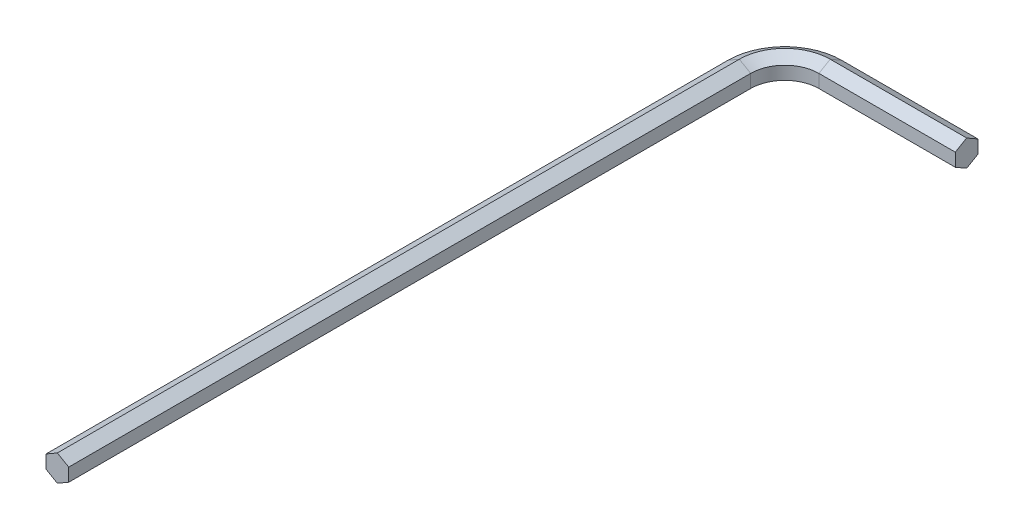
ISO-10303-21;
HEADER;
FILE_DESCRIPTION(('STEP AP214'),'2;1');
FILE_NAME('part.step','',(''),(''),'','','');
FILE_SCHEMA(('AUTOMOTIVE_DESIGN { 1 0 10303 214 1 1 1 1 }'));
ENDSEC;
DATA;
#1=APPLICATION_CONTEXT('core data for automotive mechanical design processes');
#2=APPLICATION_PROTOCOL_DEFINITION('international standard','automotive_design',2000,#1);
#3=PRODUCT_CONTEXT('',#1,'mechanical');
#4=PRODUCT('Part','Part','',(#3));
#5=PRODUCT_RELATED_PRODUCT_CATEGORY('part','',(#4));
#6=PRODUCT_DEFINITION_FORMATION('','',#4);
#7=PRODUCT_DEFINITION_CONTEXT('part definition',#1,'design');
#8=PRODUCT_DEFINITION('design','',#6,#7);
#9=PRODUCT_DEFINITION_SHAPE('','',#8);
#10=(LENGTH_UNIT() NAMED_UNIT(*) SI_UNIT(.MILLI.,.METRE.));
#11=(NAMED_UNIT(*) PLANE_ANGLE_UNIT() SI_UNIT($,.RADIAN.));
#12=(NAMED_UNIT(*) SI_UNIT($,.STERADIAN.) SOLID_ANGLE_UNIT());
#13=UNCERTAINTY_MEASURE_WITH_UNIT(LENGTH_MEASURE(1.E-05),#10,'distance_accuracy_value','');
#14=(GEOMETRIC_REPRESENTATION_CONTEXT(3) GLOBAL_UNCERTAINTY_ASSIGNED_CONTEXT((#13)) GLOBAL_UNIT_ASSIGNED_CONTEXT((#10,
#11,#12)) REPRESENTATION_CONTEXT('',''));
#15=CARTESIAN_POINT('',(0.,0.,0.));
#16=DIRECTION('',(0.,0.,1.));
#17=DIRECTION('',(1.,0.,0.));
#18=AXIS2_PLACEMENT_3D('',#15,#16,#17);
#19=CARTESIAN_POINT('',(5.,0.721687836487033,-78.75));
#20=DIRECTION('',(0.,-0.866025403784439,-0.5));
#21=DIRECTION('',(0.,0.5,-0.866025403784439));
#22=AXIS2_PLACEMENT_3D('',#19,#20,#21);
#23=PLANE('',#22);
#24=DIRECTION('',(0.,0.5,-0.866025403784438));
#25=VECTOR('',#24,1.);
#26=CARTESIAN_POINT('',(5.,0.721687836487033,-78.75));
#27=LINE('',#26,#25);
#28=CARTESIAN_POINT('',(5.,0.721687836487033,-78.75));
#29=VERTEX_POINT('',#28);
#30=CARTESIAN_POINT('',(5.,1.44337567297406,-80.));
#31=VERTEX_POINT('',#30);
#32=EDGE_CURVE('E136',#29,#31,#27,.T.);
#33=ORIENTED_EDGE('',*,*,#32,.F.);
#34=DIRECTION('',(1.,0.,0.));
#35=VECTOR('',#34,1.);
#36=CARTESIAN_POINT('',(5.,0.721687836487033,-78.75));
#37=LINE('',#36,#35);
#38=CARTESIAN_POINT('',(20.,0.721687836487033,-78.75));
#39=VERTEX_POINT('',#38);
#40=EDGE_CURVE('E41',#29,#39,#37,.T.);
#41=ORIENTED_EDGE('',*,*,#40,.T.);
#42=DIRECTION('',(0.,0.5,-0.866025403784438));
#43=VECTOR('',#42,1.);
#44=CARTESIAN_POINT('',(20.,0.721687836487033,-78.75));
#45=LINE('',#44,#43);
#46=CARTESIAN_POINT('',(20.,1.44337567297406,-80.));
#47=VERTEX_POINT('',#46);
#48=EDGE_CURVE('E48',#39,#47,#45,.T.);
#49=ORIENTED_EDGE('',*,*,#48,.T.);
#50=DIRECTION('',(1.,0.,0.));
#51=VECTOR('',#50,1.);
#52=CARTESIAN_POINT('',(5.,1.44337567297406,-80.));
#53=LINE('',#52,#51);
#54=EDGE_CURVE('E11',#31,#47,#53,.T.);
#55=ORIENTED_EDGE('',*,*,#54,.F.);
#56=EDGE_LOOP('',(#33,#41,#49,#55));
#57=FACE_BOUND('',#56,.T.);
#58=ADVANCED_FACE('F34',(#57),#23,.F.);
#59=CARTESIAN_POINT('',(5.,-0.721687836487032,-78.75));
#60=DIRECTION('',(0.,0.,-1.));
#61=DIRECTION('',(-1.,0.,0.));
#62=AXIS2_PLACEMENT_3D('',#59,#60,#61);
#63=PLANE('',#62);
#64=DIRECTION('',(0.,1.,0.));
#65=VECTOR('',#64,1.);
#66=CARTESIAN_POINT('',(5.,-0.721687836487032,-78.75));
#67=LINE('',#66,#65);
#68=CARTESIAN_POINT('',(5.,-0.721687836487032,-78.75));
#69=VERTEX_POINT('',#68);
#70=EDGE_CURVE('E205',#69,#29,#67,.T.);
#71=ORIENTED_EDGE('',*,*,#70,.F.);
#72=DIRECTION('',(1.,0.,0.));
#73=VECTOR('',#72,1.);
#74=CARTESIAN_POINT('',(5.,-0.721687836487032,-78.75));
#75=LINE('',#74,#73);
#76=CARTESIAN_POINT('',(20.,-0.721687836487032,-78.75));
#77=VERTEX_POINT('',#76);
#78=EDGE_CURVE('E241',#69,#77,#75,.T.);
#79=ORIENTED_EDGE('',*,*,#78,.T.);
#80=DIRECTION('',(0.,1.,0.));
#81=VECTOR('',#80,1.);
#82=CARTESIAN_POINT('',(20.,-0.721687836487032,-78.75));
#83=LINE('',#82,#81);
#84=EDGE_CURVE('E56',#77,#39,#83,.T.);
#85=ORIENTED_EDGE('',*,*,#84,.T.);
#86=ORIENTED_EDGE('',*,*,#40,.F.);
#87=EDGE_LOOP('',(#71,#79,#85,#86));
#88=FACE_BOUND('',#87,.T.);
#89=ADVANCED_FACE('F244',(#88),#63,.F.);
#90=CARTESIAN_POINT('',(5.,-1.44337567297406,-80.));
#91=DIRECTION('',(0.,0.866025403784439,-0.5));
#92=DIRECTION('',(0.,0.5,0.866025403784439));
#93=AXIS2_PLACEMENT_3D('',#90,#91,#92);
#94=PLANE('',#93);
#95=DIRECTION('',(0.,0.5,0.866025403784439));
#96=VECTOR('',#95,1.);
#97=CARTESIAN_POINT('',(5.,-1.44337567297406,-80.));
#98=LINE('',#97,#96);
#99=CARTESIAN_POINT('',(5.,-1.44337567297406,-80.));
#100=VERTEX_POINT('',#99);
#101=EDGE_CURVE('E202',#100,#69,#98,.T.);
#102=ORIENTED_EDGE('',*,*,#101,.F.);
#103=DIRECTION('',(1.,0.,0.));
#104=VECTOR('',#103,1.);
#105=CARTESIAN_POINT('',(5.,-1.44337567297406,-80.));
#106=LINE('',#105,#104);
#107=CARTESIAN_POINT('',(20.,-1.44337567297406,-80.));
#108=VERTEX_POINT('',#107);
#109=EDGE_CURVE('E238',#100,#108,#106,.T.);
#110=ORIENTED_EDGE('',*,*,#109,.T.);
#111=DIRECTION('',(0.,0.5,0.866025403784439));
#112=VECTOR('',#111,1.);
#113=CARTESIAN_POINT('',(20.,-1.44337567297406,-80.));
#114=LINE('',#113,#112);
#115=EDGE_CURVE('E228',#108,#77,#114,.T.);
#116=ORIENTED_EDGE('',*,*,#115,.T.);
#117=ORIENTED_EDGE('',*,*,#78,.F.);
#118=EDGE_LOOP('',(#102,#110,#116,#117));
#119=FACE_BOUND('',#118,.T.);
#120=ADVANCED_FACE('F279',(#119),#94,.F.);
#121=CARTESIAN_POINT('',(5.,-0.721687836487032,-81.25));
#122=DIRECTION('',(0.,0.866025403784439,0.5));
#123=DIRECTION('',(0.,-0.5,0.866025403784439));
#124=AXIS2_PLACEMENT_3D('',#121,#122,#123);
#125=PLANE('',#124);
#126=DIRECTION('',(0.,-0.5,0.866025403784439));
#127=VECTOR('',#126,1.);
#128=CARTESIAN_POINT('',(5.,-0.721687836487032,-81.25));
#129=LINE('',#128,#127);
#130=CARTESIAN_POINT('',(5.,-0.721687836487032,-81.25));
#131=VERTEX_POINT('',#130);
#132=EDGE_CURVE('E199',#131,#100,#129,.T.);
#133=ORIENTED_EDGE('',*,*,#132,.F.);
#134=DIRECTION('',(1.,0.,0.));
#135=VECTOR('',#134,1.);
#136=CARTESIAN_POINT('',(5.,-0.721687836487032,-81.25));
#137=LINE('',#136,#135);
#138=CARTESIAN_POINT('',(20.,-0.721687836487032,-81.25));
#139=VERTEX_POINT('',#138);
#140=EDGE_CURVE('E235',#131,#139,#137,.T.);
#141=ORIENTED_EDGE('',*,*,#140,.T.);
#142=DIRECTION('',(0.,-0.5,0.866025403784439));
#143=VECTOR('',#142,1.);
#144=CARTESIAN_POINT('',(20.,-0.721687836487032,-81.25));
#145=LINE('',#144,#143);
#146=EDGE_CURVE('E226',#139,#108,#145,.T.);
#147=ORIENTED_EDGE('',*,*,#146,.T.);
#148=ORIENTED_EDGE('',*,*,#109,.F.);
#149=EDGE_LOOP('',(#133,#141,#147,#148));
#150=FACE_BOUND('',#149,.T.);
#151=ADVANCED_FACE('F270',(#150),#125,.F.);
#152=CARTESIAN_POINT('',(5.,0.721687836487032,-81.25));
#153=DIRECTION('',(0.,0.,1.));
#154=DIRECTION('',(1.,0.,0.));
#155=AXIS2_PLACEMENT_3D('',#152,#153,#154);
#156=PLANE('',#155);
#157=DIRECTION('',(0.,-1.,0.));
#158=VECTOR('',#157,1.);
#159=CARTESIAN_POINT('',(5.,0.721687836487032,-81.25));
#160=LINE('',#159,#158);
#161=CARTESIAN_POINT('',(5.,0.721687836487032,-81.25));
#162=VERTEX_POINT('',#161);
#163=EDGE_CURVE('E197',#162,#131,#160,.T.);
#164=ORIENTED_EDGE('',*,*,#163,.F.);
#165=DIRECTION('',(1.,0.,0.));
#166=VECTOR('',#165,1.);
#167=CARTESIAN_POINT('',(5.,0.721687836487032,-81.25));
#168=LINE('',#167,#166);
#169=CARTESIAN_POINT('',(20.,0.721687836487032,-81.25));
#170=VERTEX_POINT('',#169);
#171=EDGE_CURVE('E232',#162,#170,#168,.T.);
#172=ORIENTED_EDGE('',*,*,#171,.T.);
#173=DIRECTION('',(0.,-1.,0.));
#174=VECTOR('',#173,1.);
#175=CARTESIAN_POINT('',(20.,0.721687836487032,-81.25));
#176=LINE('',#175,#174);
#177=EDGE_CURVE('E224',#170,#139,#176,.T.);
#178=ORIENTED_EDGE('',*,*,#177,.T.);
#179=ORIENTED_EDGE('',*,*,#140,.F.);
#180=EDGE_LOOP('',(#164,#172,#178,#179));
#181=FACE_BOUND('',#180,.T.);
#182=ADVANCED_FACE('F273',(#181),#156,.F.);
#183=CARTESIAN_POINT('',(5.,1.44337567297406,-80.));
#184=DIRECTION('',(0.,-0.866025403784439,0.5));
#185=DIRECTION('',(0.,-0.5,-0.866025403784439));
#186=AXIS2_PLACEMENT_3D('',#183,#184,#185);
#187=PLANE('',#186);
#188=DIRECTION('',(0.,-0.5,-0.866025403784439));
#189=VECTOR('',#188,1.);
#190=CARTESIAN_POINT('',(5.,1.44337567297406,-80.));
#191=LINE('',#190,#189);
#192=EDGE_CURVE('E132',#31,#162,#191,.T.);
#193=ORIENTED_EDGE('',*,*,#192,.F.);
#194=ORIENTED_EDGE('',*,*,#54,.T.);
#195=DIRECTION('',(0.,-0.5,-0.866025403784439));
#196=VECTOR('',#195,1.);
#197=CARTESIAN_POINT('',(20.,1.44337567297406,-80.));
#198=LINE('',#197,#196);
#199=EDGE_CURVE('E222',#47,#170,#198,.T.);
#200=ORIENTED_EDGE('',*,*,#199,.T.);
#201=ORIENTED_EDGE('',*,*,#171,.F.);
#202=EDGE_LOOP('',(#193,#194,#200,#201));
#203=FACE_BOUND('',#202,.T.);
#204=ADVANCED_FACE('F313',(#203),#187,.F.);
#205=CARTESIAN_POINT('',(5.,0.721687836487033,-75.));
#206=DIRECTION('',(0.,1.,0.));
#207=DIRECTION('',(0.,0.,1.));
#208=AXIS2_PLACEMENT_3D('',#205,#206,#207);
#209=CONICAL_SURFACE('',#208,3.75,1.0471975511966);
#210=DIRECTION('',(-0.866025403784438,0.5,0.));
#211=VECTOR('',#210,1.);
#212=CARTESIAN_POINT('',(1.25,0.721687836487033,-75.));
#213=LINE('',#212,#211);
#214=CARTESIAN_POINT('',(1.25,0.721687836487033,-75.));
#215=VERTEX_POINT('',#214);
#216=CARTESIAN_POINT('',(0.,1.44337567297406,-75.));
#217=VERTEX_POINT('',#216);
#218=EDGE_CURVE('E156',#215,#217,#213,.T.);
#219=ORIENTED_EDGE('',*,*,#218,.F.);
#220=CARTESIAN_POINT('',(5.,0.721687836487033,-75.));
#221=DIRECTION('',(0.,-1.,0.));
#222=DIRECTION('',(0.,0.,-1.));
#223=AXIS2_PLACEMENT_3D('',#220,#221,#222);
#224=CIRCLE('',#223,3.75);
#225=EDGE_CURVE('E217',#215,#29,#224,.T.);
#226=ORIENTED_EDGE('',*,*,#225,.T.);
#227=ORIENTED_EDGE('',*,*,#32,.T.);
#228=CARTESIAN_POINT('',(5.,1.44337567297406,-75.));
#229=DIRECTION('',(0.,-1.,0.));
#230=DIRECTION('',(0.,0.,-1.));
#231=AXIS2_PLACEMENT_3D('',#228,#229,#230);
#232=CIRCLE('',#231,5.);
#233=EDGE_CURVE('E220',#217,#31,#232,.T.);
#234=ORIENTED_EDGE('',*,*,#233,.F.);
#235=EDGE_LOOP('',(#219,#226,#227,#234));
#236=FACE_BOUND('',#235,.T.);
#237=ADVANCED_FACE('F322',(#236),#209,.F.);
#238=CARTESIAN_POINT('',(5.,0.,-75.));
#239=DIRECTION('',(0.,-1.,0.));
#240=DIRECTION('',(0.,0.,-1.));
#241=AXIS2_PLACEMENT_3D('',#238,#239,#240);
#242=CYLINDRICAL_SURFACE('',#241,3.75);
#243=DIRECTION('',(0.,1.,0.));
#244=VECTOR('',#243,1.);
#245=CARTESIAN_POINT('',(1.25,-0.721687836487032,-75.));
#246=LINE('',#245,#244);
#247=CARTESIAN_POINT('',(1.25,-0.721687836487032,-75.));
#248=VERTEX_POINT('',#247);
#249=EDGE_CURVE('E172',#248,#215,#246,.T.);
#250=ORIENTED_EDGE('',*,*,#249,.F.);
#251=CARTESIAN_POINT('',(5.,-0.721687836487032,-75.));
#252=DIRECTION('',(0.,-1.,0.));
#253=DIRECTION('',(0.,0.,-1.));
#254=AXIS2_PLACEMENT_3D('',#251,#252,#253);
#255=CIRCLE('',#254,3.75);
#256=EDGE_CURVE('E214',#248,#69,#255,.T.);
#257=ORIENTED_EDGE('',*,*,#256,.T.);
#258=ORIENTED_EDGE('',*,*,#70,.T.);
#259=ORIENTED_EDGE('',*,*,#225,.F.);
#260=EDGE_LOOP('',(#250,#257,#258,#259));
#261=FACE_BOUND('',#260,.T.);
#262=ADVANCED_FACE('F252',(#261),#242,.F.);
#263=CARTESIAN_POINT('',(5.,-1.44337567297406,-75.));
#264=DIRECTION('',(0.,-1.,0.));
#265=DIRECTION('',(0.,0.,-1.));
#266=AXIS2_PLACEMENT_3D('',#263,#264,#265);
#267=CONICAL_SURFACE('',#266,5.,1.0471975511966);
#268=DIRECTION('',(0.866025403784439,0.5,0.));
#269=VECTOR('',#268,1.);
#270=CARTESIAN_POINT('',(0.,-1.44337567297406,-75.));
#271=LINE('',#270,#269);
#272=CARTESIAN_POINT('',(0.,-1.44337567297406,-75.));
#273=VERTEX_POINT('',#272);
#274=EDGE_CURVE('E169',#273,#248,#271,.T.);
#275=ORIENTED_EDGE('',*,*,#274,.F.);
#276=CARTESIAN_POINT('',(5.,-1.44337567297406,-75.));
#277=DIRECTION('',(0.,-1.,0.));
#278=DIRECTION('',(0.,0.,-1.));
#279=AXIS2_PLACEMENT_3D('',#276,#277,#278);
#280=CIRCLE('',#279,5.);
#281=EDGE_CURVE('E211',#273,#100,#280,.T.);
#282=ORIENTED_EDGE('',*,*,#281,.T.);
#283=ORIENTED_EDGE('',*,*,#101,.T.);
#284=ORIENTED_EDGE('',*,*,#256,.F.);
#285=EDGE_LOOP('',(#275,#282,#283,#284));
#286=FACE_BOUND('',#285,.T.);
#287=ADVANCED_FACE('F249',(#286),#267,.F.);
#288=CARTESIAN_POINT('',(5.,-0.721687836487032,-75.));
#289=DIRECTION('',(0.,1.,0.));
#290=DIRECTION('',(0.,0.,1.));
#291=AXIS2_PLACEMENT_3D('',#288,#289,#290);
#292=CONICAL_SURFACE('',#291,6.25,1.0471975511966);
#293=DIRECTION('',(0.866025403784439,-0.5,0.));
#294=VECTOR('',#293,1.);
#295=CARTESIAN_POINT('',(-1.25,-0.721687836487032,-75.));
#296=LINE('',#295,#294);
#297=CARTESIAN_POINT('',(-1.25,-0.721687836487032,-75.));
#298=VERTEX_POINT('',#297);
#299=EDGE_CURVE('E145',#298,#273,#296,.T.);
#300=ORIENTED_EDGE('',*,*,#299,.F.);
#301=CARTESIAN_POINT('',(5.,-0.721687836487032,-75.));
#302=DIRECTION('',(0.,-1.,0.));
#303=DIRECTION('',(0.,0.,-1.));
#304=AXIS2_PLACEMENT_3D('',#301,#302,#303);
#305=CIRCLE('',#304,6.25);
#306=EDGE_CURVE('E135',#298,#131,#305,.T.);
#307=ORIENTED_EDGE('',*,*,#306,.T.);
#308=ORIENTED_EDGE('',*,*,#132,.T.);
#309=ORIENTED_EDGE('',*,*,#281,.F.);
#310=EDGE_LOOP('',(#300,#307,#308,#309));
#311=FACE_BOUND('',#310,.T.);
#312=ADVANCED_FACE('F267',(#311),#292,.T.);
#313=CARTESIAN_POINT('',(5.,0.,-75.));
#314=DIRECTION('',(0.,-1.,0.));
#315=DIRECTION('',(0.,0.,-1.));
#316=AXIS2_PLACEMENT_3D('',#313,#314,#315);
#317=CYLINDRICAL_SURFACE('',#316,6.25);
#318=DIRECTION('',(0.,-1.,0.));
#319=VECTOR('',#318,1.);
#320=CARTESIAN_POINT('',(-1.25,0.721687836487032,-75.));
#321=LINE('',#320,#319);
#322=CARTESIAN_POINT('',(-1.25,0.721687836487032,-75.));
#323=VERTEX_POINT('',#322);
#324=EDGE_CURVE('E139',#323,#298,#321,.T.);
#325=ORIENTED_EDGE('',*,*,#324,.F.);
#326=CARTESIAN_POINT('',(5.,0.721687836487032,-75.));
#327=DIRECTION('',(0.,-1.,0.));
#328=DIRECTION('',(0.,0.,-1.));
#329=AXIS2_PLACEMENT_3D('',#326,#327,#328);
#330=CIRCLE('',#329,6.25);
#331=EDGE_CURVE('E124',#323,#162,#330,.T.);
#332=ORIENTED_EDGE('',*,*,#331,.T.);
#333=ORIENTED_EDGE('',*,*,#163,.T.);
#334=ORIENTED_EDGE('',*,*,#306,.F.);
#335=EDGE_LOOP('',(#325,#332,#333,#334));
#336=FACE_BOUND('',#335,.T.);
#337=ADVANCED_FACE('F141',(#336),#317,.T.);
#338=CARTESIAN_POINT('',(5.,1.44337567297406,-75.));
#339=DIRECTION('',(0.,-1.,0.));
#340=DIRECTION('',(0.,0.,-1.));
#341=AXIS2_PLACEMENT_3D('',#338,#339,#340);
#342=CONICAL_SURFACE('',#341,5.,1.0471975511966);
#343=DIRECTION('',(-0.866025403784439,-0.5,0.));
#344=VECTOR('',#343,1.);
#345=CARTESIAN_POINT('',(0.,1.44337567297406,-75.));
#346=LINE('',#345,#344);
#347=EDGE_CURVE('E129',#217,#323,#346,.T.);
#348=ORIENTED_EDGE('',*,*,#347,.F.);
#349=ORIENTED_EDGE('',*,*,#233,.T.);
#350=ORIENTED_EDGE('',*,*,#192,.T.);
#351=ORIENTED_EDGE('',*,*,#331,.F.);
#352=EDGE_LOOP('',(#348,#349,#350,#351));
#353=FACE_BOUND('',#352,.T.);
#354=ADVANCED_FACE('F126',(#353),#342,.T.);
#355=CARTESIAN_POINT('',(0.,1.44337567297406,-75.));
#356=DIRECTION('',(-0.5,0.866025403784439,0.));
#357=DIRECTION('',(-0.866025403784439,-0.5,0.));
#358=AXIS2_PLACEMENT_3D('',#355,#356,#357);
#359=PLANE('',#358);
#360=DIRECTION('',(-0.866025403784439,-0.5,0.));
#361=VECTOR('',#360,1.);
#362=CARTESIAN_POINT('',(0.,1.44337567297406,0.));
#363=LINE('',#362,#361);
#364=CARTESIAN_POINT('',(0.,1.44337567297406,0.));
#365=VERTEX_POINT('',#364);
#366=CARTESIAN_POINT('',(-1.25,0.721687836487032,0.));
#367=VERTEX_POINT('',#366);
#368=EDGE_CURVE('E176',#365,#367,#363,.T.);
#369=ORIENTED_EDGE('',*,*,#368,.F.);
#370=DIRECTION('',(0.,0.,1.));
#371=VECTOR('',#370,1.);
#372=CARTESIAN_POINT('',(0.,1.44337567297406,-75.));
#373=LINE('',#372,#371);
#374=EDGE_CURVE('E159',#217,#365,#373,.T.);
#375=ORIENTED_EDGE('',*,*,#374,.F.);
#376=ORIENTED_EDGE('',*,*,#347,.T.);
#377=DIRECTION('',(0.,0.,1.));
#378=VECTOR('',#377,1.);
#379=CARTESIAN_POINT('',(-1.25,0.721687836487032,-75.));
#380=LINE('',#379,#378);
#381=EDGE_CURVE('E148',#323,#367,#380,.T.);
#382=ORIENTED_EDGE('',*,*,#381,.T.);
#383=EDGE_LOOP('',(#369,#375,#376,#382));
#384=FACE_BOUND('',#383,.T.);
#385=ADVANCED_FACE('F158',(#384),#359,.T.);
#386=CARTESIAN_POINT('',(1.25,0.721687836487033,-75.));
#387=DIRECTION('',(0.5,0.866025403784438,0.));
#388=DIRECTION('',(-0.866025403784439,0.5,0.));
#389=AXIS2_PLACEMENT_3D('',#386,#387,#388);
#390=PLANE('',#389);
#391=DIRECTION('',(-0.866025403784438,0.5,0.));
#392=VECTOR('',#391,1.);
#393=CARTESIAN_POINT('',(1.25,0.721687836487033,0.));
#394=LINE('',#393,#392);
#395=CARTESIAN_POINT('',(1.25,0.721687836487033,0.));
#396=VERTEX_POINT('',#395);
#397=EDGE_CURVE('E161',#396,#365,#394,.T.);
#398=ORIENTED_EDGE('',*,*,#397,.F.);
#399=DIRECTION('',(0.,0.,1.));
#400=VECTOR('',#399,1.);
#401=CARTESIAN_POINT('',(1.25,0.721687836487033,-75.));
#402=LINE('',#401,#400);
#403=EDGE_CURVE('E188',#215,#396,#402,.T.);
#404=ORIENTED_EDGE('',*,*,#403,.F.);
#405=ORIENTED_EDGE('',*,*,#218,.T.);
#406=ORIENTED_EDGE('',*,*,#374,.T.);
#407=EDGE_LOOP('',(#398,#404,#405,#406));
#408=FACE_BOUND('',#407,.T.);
#409=ADVANCED_FACE('F381',(#408),#390,.T.);
#410=CARTESIAN_POINT('',(1.25,-0.721687836487032,-75.));
#411=DIRECTION('',(1.,0.,0.));
#412=DIRECTION('',(0.,0.,-1.));
#413=AXIS2_PLACEMENT_3D('',#410,#411,#412);
#414=PLANE('',#413);
#415=DIRECTION('',(0.,1.,0.));
#416=VECTOR('',#415,1.);
#417=CARTESIAN_POINT('',(1.25,-0.721687836487032,0.));
#418=LINE('',#417,#416);
#419=CARTESIAN_POINT('',(1.25,-0.721687836487032,0.));
#420=VERTEX_POINT('',#419);
#421=EDGE_CURVE('E164',#420,#396,#418,.T.);
#422=ORIENTED_EDGE('',*,*,#421,.F.);
#423=DIRECTION('',(0.,0.,1.));
#424=VECTOR('',#423,1.);
#425=CARTESIAN_POINT('',(1.25,-0.721687836487032,-75.));
#426=LINE('',#425,#424);
#427=EDGE_CURVE('E191',#248,#420,#426,.T.);
#428=ORIENTED_EDGE('',*,*,#427,.F.);
#429=ORIENTED_EDGE('',*,*,#249,.T.);
#430=ORIENTED_EDGE('',*,*,#403,.T.);
#431=EDGE_LOOP('',(#422,#428,#429,#430));
#432=FACE_BOUND('',#431,.T.);
#433=ADVANCED_FACE('F257',(#432),#414,.T.);
#434=CARTESIAN_POINT('',(0.,-1.44337567297406,-75.));
#435=DIRECTION('',(0.5,-0.866025403784438,0.));
#436=DIRECTION('',(0.866025403784439,0.5,0.));
#437=AXIS2_PLACEMENT_3D('',#434,#435,#436);
#438=PLANE('',#437);
#439=DIRECTION('',(0.866025403784439,0.5,0.));
#440=VECTOR('',#439,1.);
#441=CARTESIAN_POINT('',(0.,-1.44337567297406,0.));
#442=LINE('',#441,#440);
#443=CARTESIAN_POINT('',(0.,-1.44337567297406,0.));
#444=VERTEX_POINT('',#443);
#445=EDGE_CURVE('E182',#444,#420,#442,.T.);
#446=ORIENTED_EDGE('',*,*,#445,.F.);
#447=DIRECTION('',(0.,0.,1.));
#448=VECTOR('',#447,1.);
#449=CARTESIAN_POINT('',(0.,-1.44337567297406,-75.));
#450=LINE('',#449,#448);
#451=EDGE_CURVE('E193',#273,#444,#450,.T.);
#452=ORIENTED_EDGE('',*,*,#451,.F.);
#453=ORIENTED_EDGE('',*,*,#274,.T.);
#454=ORIENTED_EDGE('',*,*,#427,.T.);
#455=EDGE_LOOP('',(#446,#452,#453,#454));
#456=FACE_BOUND('',#455,.T.);
#457=ADVANCED_FACE('F261',(#456),#438,.T.);
#458=CARTESIAN_POINT('',(-1.25,-0.721687836487032,-75.));
#459=DIRECTION('',(-0.5,-0.866025403784439,0.));
#460=DIRECTION('',(0.866025403784439,-0.5,0.));
#461=AXIS2_PLACEMENT_3D('',#458,#459,#460);
#462=PLANE('',#461);
#463=DIRECTION('',(0.866025403784439,-0.5,0.));
#464=VECTOR('',#463,1.);
#465=CARTESIAN_POINT('',(-1.25,-0.721687836487032,0.));
#466=LINE('',#465,#464);
#467=CARTESIAN_POINT('',(-1.25,-0.721687836487032,0.));
#468=VERTEX_POINT('',#467);
#469=EDGE_CURVE('E179',#468,#444,#466,.T.);
#470=ORIENTED_EDGE('',*,*,#469,.F.);
#471=DIRECTION('',(0.,0.,1.));
#472=VECTOR('',#471,1.);
#473=CARTESIAN_POINT('',(-1.25,-0.721687836487032,-75.));
#474=LINE('',#473,#472);
#475=EDGE_CURVE('E155',#298,#468,#474,.T.);
#476=ORIENTED_EDGE('',*,*,#475,.F.);
#477=ORIENTED_EDGE('',*,*,#299,.T.);
#478=ORIENTED_EDGE('',*,*,#451,.T.);
#479=EDGE_LOOP('',(#470,#476,#477,#478));
#480=FACE_BOUND('',#479,.T.);
#481=ADVANCED_FACE('F265',(#480),#462,.T.);
#482=CARTESIAN_POINT('',(-1.25,0.721687836487032,-75.));
#483=DIRECTION('',(-1.,0.,0.));
#484=DIRECTION('',(0.,0.,1.));
#485=AXIS2_PLACEMENT_3D('',#482,#483,#484);
#486=PLANE('',#485);
#487=DIRECTION('',(0.,-1.,0.));
#488=VECTOR('',#487,1.);
#489=CARTESIAN_POINT('',(-1.25,0.721687836487032,0.));
#490=LINE('',#489,#488);
#491=EDGE_CURVE('E151',#367,#468,#490,.T.);
#492=ORIENTED_EDGE('',*,*,#491,.F.);
#493=ORIENTED_EDGE('',*,*,#381,.F.);
#494=ORIENTED_EDGE('',*,*,#324,.T.);
#495=ORIENTED_EDGE('',*,*,#475,.T.);
#496=EDGE_LOOP('',(#492,#493,#494,#495));
#497=FACE_BOUND('',#496,.T.);
#498=ADVANCED_FACE('F149',(#497),#486,.T.);
#499=CARTESIAN_POINT('',(20.,0.,-80.));
#500=DIRECTION('',(-1.,0.,0.));
#501=DIRECTION('',(0.,0.,1.));
#502=AXIS2_PLACEMENT_3D('',#499,#500,#501);
#503=PLANE('',#502);
#504=ORIENTED_EDGE('',*,*,#199,.F.);
#505=ORIENTED_EDGE('',*,*,#48,.F.);
#506=ORIENTED_EDGE('',*,*,#84,.F.);
#507=ORIENTED_EDGE('',*,*,#115,.F.);
#508=ORIENTED_EDGE('',*,*,#146,.F.);
#509=ORIENTED_EDGE('',*,*,#177,.F.);
#510=EDGE_LOOP('',(#504,#505,#506,#507,#508,#509));
#511=FACE_BOUND('',#510,.T.);
#512=ADVANCED_FACE('F278',(#511),#503,.F.);
#513=CARTESIAN_POINT('',(0.,0.,0.));
#514=DIRECTION('',(0.,0.,1.));
#515=DIRECTION('',(1.,0.,0.));
#516=AXIS2_PLACEMENT_3D('',#513,#514,#515);
#517=PLANE('',#516);
#518=ORIENTED_EDGE('',*,*,#368,.T.);
#519=ORIENTED_EDGE('',*,*,#491,.T.);
#520=ORIENTED_EDGE('',*,*,#469,.T.);
#521=ORIENTED_EDGE('',*,*,#445,.T.);
#522=ORIENTED_EDGE('',*,*,#421,.T.);
#523=ORIENTED_EDGE('',*,*,#397,.T.);
#524=EDGE_LOOP('',(#518,#519,#520,#521,#522,#523));
#525=FACE_BOUND('',#524,.T.);
#526=ADVANCED_FACE('F431',(#525),#517,.T.);
#527=CLOSED_SHELL('',(#58,#89,#120,#151,#182,#204,#237,#262,#287,#312,#337,#354,#385,#409,#433,
#457,#481,#498,#512,#526));
#528=MANIFOLD_SOLID_BREP('B2',#527);
#529=ADVANCED_BREP_SHAPE_REPRESENTATION('',(#18,#528),#14);
#530=SHAPE_DEFINITION_REPRESENTATION(#9,#529);
ENDSEC;
END-ISO-10303-21;
